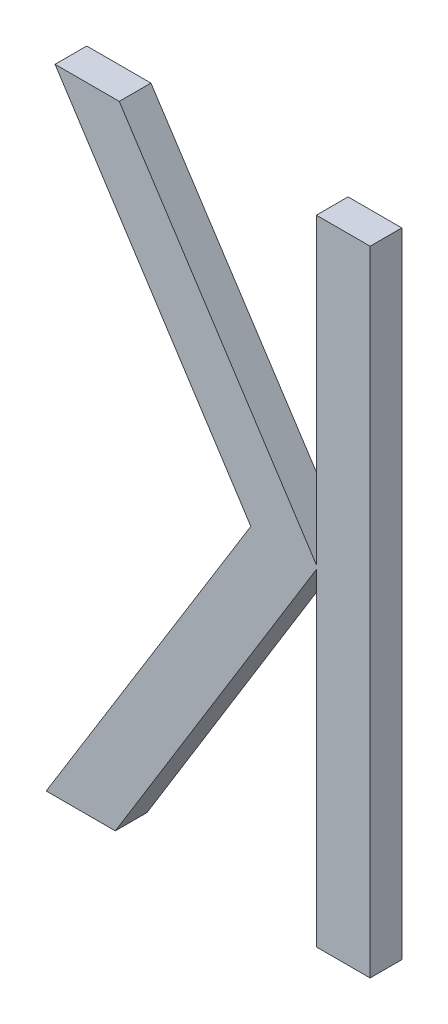
ISO-10303-21;
HEADER;
FILE_DESCRIPTION(('STEP AP214'),'2;1');
FILE_NAME('part.step','',(''),(''),'','','');
FILE_SCHEMA(('AUTOMOTIVE_DESIGN { 1 0 10303 214 1 1 1 1 }'));
ENDSEC;
DATA;
#1=APPLICATION_CONTEXT('core data for automotive mechanical design processes');
#2=APPLICATION_PROTOCOL_DEFINITION('international standard','automotive_design',2000,#1);
#3=PRODUCT_CONTEXT('',#1,'mechanical');
#4=PRODUCT('Part','Part','',(#3));
#5=PRODUCT_RELATED_PRODUCT_CATEGORY('part','',(#4));
#6=PRODUCT_DEFINITION_FORMATION('','',#4);
#7=PRODUCT_DEFINITION_CONTEXT('part definition',#1,'design');
#8=PRODUCT_DEFINITION('design','',#6,#7);
#9=PRODUCT_DEFINITION_SHAPE('','',#8);
#10=(LENGTH_UNIT() NAMED_UNIT(*) SI_UNIT(.MILLI.,.METRE.));
#11=(NAMED_UNIT(*) PLANE_ANGLE_UNIT() SI_UNIT($,.RADIAN.));
#12=(NAMED_UNIT(*) SI_UNIT($,.STERADIAN.) SOLID_ANGLE_UNIT());
#13=UNCERTAINTY_MEASURE_WITH_UNIT(LENGTH_MEASURE(1.E-05),#10,'distance_accuracy_value','');
#14=(GEOMETRIC_REPRESENTATION_CONTEXT(3) GLOBAL_UNCERTAINTY_ASSIGNED_CONTEXT((#13)) GLOBAL_UNIT_ASSIGNED_CONTEXT((#10,
#11,#12)) REPRESENTATION_CONTEXT('',''));
#15=CARTESIAN_POINT('',(0.,0.,0.));
#16=DIRECTION('',(0.,0.,1.));
#17=DIRECTION('',(1.,0.,0.));
#18=AXIS2_PLACEMENT_3D('',#15,#16,#17);
#19=CARTESIAN_POINT('',(184.61228862692,129.252300359681,-38.9997200126349));
#20=DIRECTION('',(0.,0.,-1.));
#21=DIRECTION('',(-1.,0.,0.));
#22=AXIS2_PLACEMENT_3D('',#19,#20,#21);
#23=PLANE('',#22);
#24=DIRECTION('',(0.,1.,0.));
#25=VECTOR('',#24,1.);
#26=CARTESIAN_POINT('',(184.697083866219,129.252300359681,-38.9997200126349));
#27=LINE('',#26,#25);
#28=CARTESIAN_POINT('',(184.697083866219,131.252300359681,-38.9997200126349));
#29=VERTEX_POINT('',#28);
#30=CARTESIAN_POINT('',(184.697083866219,129.252300359681,-38.9997200126349));
#31=VERTEX_POINT('',#30);
#32=EDGE_CURVE('E163',#29,#31,#27,.F.);
#33=ORIENTED_EDGE('',*,*,#32,.F.);
#34=DIRECTION('',(1.,0.,0.));
#35=VECTOR('',#34,1.);
#36=CARTESIAN_POINT('',(184.697083866219,131.252300359681,-38.9997200126349));
#37=LINE('',#36,#35);
#38=CARTESIAN_POINT('',(184.527493387621,131.252300359681,-38.9997200126349));
#39=VERTEX_POINT('',#38);
#40=EDGE_CURVE('E158',#39,#29,#37,.T.);
#41=ORIENTED_EDGE('',*,*,#40,.F.);
#42=DIRECTION('',(0.,1.,0.));
#43=VECTOR('',#42,1.);
#44=CARTESIAN_POINT('',(184.527493387621,131.252300359681,-38.9997200126349));
#45=LINE('',#44,#43);
#46=CARTESIAN_POINT('',(184.527493387621,130.296768332154,-38.9997200126349));
#47=VERTEX_POINT('',#46);
#48=EDGE_CURVE('E152',#47,#39,#45,.T.);
#49=ORIENTED_EDGE('',*,*,#48,.F.);
#50=DIRECTION('',(-0.545601462088926,0.838044774798117,0.));
#51=VECTOR('',#50,1.);
#52=CARTESIAN_POINT('',(184.527493387621,130.296768332154,-38.9997200126349));
#53=LINE('',#52,#51);
#54=CARTESIAN_POINT('',(183.905402913496,131.252300359681,-38.9997200126349));
#55=VERTEX_POINT('',#54);
#56=EDGE_CURVE('E146',#55,#47,#53,.F.);
#57=ORIENTED_EDGE('',*,*,#56,.F.);
#58=DIRECTION('',(1.,0.,0.));
#59=VECTOR('',#58,1.);
#60=CARTESIAN_POINT('',(183.905402913496,131.252300359681,-38.9997200126349));
#61=LINE('',#60,#59);
#62=CARTESIAN_POINT('',(183.702825728535,131.252300359681,-38.9997200126349));
#63=VERTEX_POINT('',#62);
#64=EDGE_CURVE('E140',#63,#55,#61,.T.);
#65=ORIENTED_EDGE('',*,*,#64,.F.);
#66=DIRECTION('',(0.543600897919909,-0.839343829298023,0.));
#67=VECTOR('',#66,1.);
#68=CARTESIAN_POINT('',(183.702825728535,131.252300359681,-38.9997200126349));
#69=LINE('',#68,#67);
#70=CARTESIAN_POINT('',(184.320647334777,130.298356474028,-38.9997200126349));
#71=VERTEX_POINT('',#70);
#72=EDGE_CURVE('E134',#71,#63,#69,.F.);
#73=ORIENTED_EDGE('',*,*,#72,.F.);
#74=DIRECTION('',(-0.525298439908608,-0.850918062465231,0.));
#75=VECTOR('',#74,1.);
#76=CARTESIAN_POINT('',(184.320647334777,130.298356474028,-38.9997200126349));
#77=LINE('',#76,#75);
#78=CARTESIAN_POINT('',(183.67488404785,129.252300359681,-38.9997200126349));
#79=VERTEX_POINT('',#78);
#80=EDGE_CURVE('E128',#79,#71,#77,.F.);
#81=ORIENTED_EDGE('',*,*,#80,.F.);
#82=DIRECTION('',(1.,0.,0.));
#83=VECTOR('',#82,1.);
#84=CARTESIAN_POINT('',(183.67488404785,129.252300359681,-38.9997200126349));
#85=LINE('',#84,#83);
#86=CARTESIAN_POINT('',(183.892984388747,129.252300359681,-38.9997200126349));
#87=VERTEX_POINT('',#86);
#88=EDGE_CURVE('E122',#87,#79,#85,.F.);
#89=ORIENTED_EDGE('',*,*,#88,.F.);
#90=DIRECTION('',(0.523844714133863,0.85181377980989,0.));
#91=VECTOR('',#90,1.);
#92=CARTESIAN_POINT('',(183.892984388747,129.252300359681,-38.9997200126349));
#93=LINE('',#92,#91);
#94=CARTESIAN_POINT('',(184.527493387621,130.284063197162,-38.9997200126349));
#95=VERTEX_POINT('',#94);
#96=EDGE_CURVE('E98',#95,#87,#93,.F.);
#97=ORIENTED_EDGE('',*,*,#96,.F.);
#98=DIRECTION('',(0.,1.,0.));
#99=VECTOR('',#98,1.);
#100=CARTESIAN_POINT('',(184.527493387621,130.284063197162,-38.9997200126349));
#101=LINE('',#100,#99);
#102=CARTESIAN_POINT('',(184.527493387621,129.252300359681,-38.9997200126349));
#103=VERTEX_POINT('',#102);
#104=EDGE_CURVE('E100',#103,#95,#101,.T.);
#105=ORIENTED_EDGE('',*,*,#104,.F.);
#106=DIRECTION('',(1.,0.,0.));
#107=VECTOR('',#106,1.);
#108=CARTESIAN_POINT('',(184.527493387621,129.252300359681,-38.9997200126349));
#109=LINE('',#108,#107);
#110=EDGE_CURVE('E20',#31,#103,#109,.F.);
#111=ORIENTED_EDGE('',*,*,#110,.F.);
#112=EDGE_LOOP('',(#33,#41,#49,#57,#65,#73,#81,#89,#97,#105,#111));
#113=FACE_BOUND('',#112,.T.);
#114=ADVANCED_FACE('F17',(#113),#23,.F.);
#115=CARTESIAN_POINT('',(184.527493387621,129.252300359681,-39.0997200126349));
#116=DIRECTION('',(0.,-1.,0.));
#117=DIRECTION('',(0.,0.,-1.));
#118=AXIS2_PLACEMENT_3D('',#115,#116,#117);
#119=PLANE('',#118);
#120=DIRECTION('',(-1.,0.,0.));
#121=VECTOR('',#120,1.);
#122=CARTESIAN_POINT('',(184.61228862692,129.252300359681,-39.0997200126349));
#123=LINE('',#122,#121);
#124=CARTESIAN_POINT('',(184.697083866219,129.252300359681,-39.0997200126349));
#125=VERTEX_POINT('',#124);
#126=CARTESIAN_POINT('',(184.527493387621,129.252300359681,-39.0997200126349));
#127=VERTEX_POINT('',#126);
#128=EDGE_CURVE('E167',#125,#127,#123,.T.);
#129=ORIENTED_EDGE('',*,*,#128,.F.);
#130=DIRECTION('',(0.,0.,-1.));
#131=VECTOR('',#130,1.);
#132=CARTESIAN_POINT('',(184.697083866219,129.252300359681,-39.0997200126349));
#133=LINE('',#132,#131);
#134=EDGE_CURVE('E111',#31,#125,#133,.T.);
#135=ORIENTED_EDGE('',*,*,#134,.F.);
#136=ORIENTED_EDGE('',*,*,#110,.T.);
#137=DIRECTION('',(0.,0.,1.));
#138=VECTOR('',#137,1.);
#139=CARTESIAN_POINT('',(184.527493387621,129.252300359681,-39.0997200126349));
#140=LINE('',#139,#138);
#141=EDGE_CURVE('E106',#127,#103,#140,.T.);
#142=ORIENTED_EDGE('',*,*,#141,.F.);
#143=EDGE_LOOP('',(#129,#135,#136,#142));
#144=FACE_BOUND('',#143,.T.);
#145=ADVANCED_FACE('F108',(#144),#119,.T.);
#146=CARTESIAN_POINT('',(184.527493387621,130.284063197162,-39.0997200126349));
#147=DIRECTION('',(-1.,0.,0.));
#148=DIRECTION('',(0.,0.,1.));
#149=AXIS2_PLACEMENT_3D('',#146,#147,#148);
#150=PLANE('',#149);
#151=DIRECTION('',(0.,1.,0.));
#152=VECTOR('',#151,1.);
#153=CARTESIAN_POINT('',(184.527493387621,129.252300359681,-39.0997200126349));
#154=LINE('',#153,#152);
#155=CARTESIAN_POINT('',(184.527493387621,130.284063197162,-39.0997200126349));
#156=VERTEX_POINT('',#155);
#157=EDGE_CURVE('E115',#127,#156,#154,.T.);
#158=ORIENTED_EDGE('',*,*,#157,.F.);
#159=ORIENTED_EDGE('',*,*,#141,.T.);
#160=ORIENTED_EDGE('',*,*,#104,.T.);
#161=DIRECTION('',(0.,0.,1.));
#162=VECTOR('',#161,1.);
#163=CARTESIAN_POINT('',(184.527493387621,130.284063197162,-39.0997200126349));
#164=LINE('',#163,#162);
#165=EDGE_CURVE('E118',#156,#95,#164,.T.);
#166=ORIENTED_EDGE('',*,*,#165,.F.);
#167=EDGE_LOOP('',(#158,#159,#160,#166));
#168=FACE_BOUND('',#167,.T.);
#169=ADVANCED_FACE('F113',(#168),#150,.T.);
#170=CARTESIAN_POINT('',(183.892984388747,129.252300359681,-39.0997200126349));
#171=DIRECTION('',(0.85181377980989,-0.523844714133863,0.));
#172=DIRECTION('',(0.523844714133863,0.85181377980989,0.));
#173=AXIS2_PLACEMENT_3D('',#170,#171,#172);
#174=PLANE('',#173);
#175=DIRECTION('',(-0.523844714133879,-0.85181377980988,0.));
#176=VECTOR('',#175,1.);
#177=CARTESIAN_POINT('',(184.527493387621,130.284063197162,-39.0997200126349));
#178=LINE('',#177,#176);
#179=CARTESIAN_POINT('',(183.892984388747,129.252300359681,-39.0997200126349));
#180=VERTEX_POINT('',#179);
#181=EDGE_CURVE('E170',#156,#180,#178,.T.);
#182=ORIENTED_EDGE('',*,*,#181,.F.);
#183=ORIENTED_EDGE('',*,*,#165,.T.);
#184=ORIENTED_EDGE('',*,*,#96,.T.);
#185=DIRECTION('',(0.,0.,-1.));
#186=VECTOR('',#185,1.);
#187=CARTESIAN_POINT('',(183.892984388747,129.252300359681,-39.0997200126349));
#188=LINE('',#187,#186);
#189=EDGE_CURVE('E125',#180,#87,#188,.F.);
#190=ORIENTED_EDGE('',*,*,#189,.F.);
#191=EDGE_LOOP('',(#182,#183,#184,#190));
#192=FACE_BOUND('',#191,.T.);
#193=ADVANCED_FACE('F215',(#192),#174,.T.);
#194=CARTESIAN_POINT('',(183.67488404785,129.252300359681,-39.0997200126349));
#195=DIRECTION('',(0.,-1.,0.));
#196=DIRECTION('',(0.,0.,-1.));
#197=AXIS2_PLACEMENT_3D('',#194,#195,#196);
#198=PLANE('',#197);
#199=DIRECTION('',(-1.,0.,0.));
#200=VECTOR('',#199,1.);
#201=CARTESIAN_POINT('',(184.61228862692,129.252300359681,-39.0997200126349));
#202=LINE('',#201,#200);
#203=CARTESIAN_POINT('',(183.67488404785,129.252300359681,-39.0997200126349));
#204=VERTEX_POINT('',#203);
#205=EDGE_CURVE('E173',#180,#204,#202,.T.);
#206=ORIENTED_EDGE('',*,*,#205,.F.);
#207=ORIENTED_EDGE('',*,*,#189,.T.);
#208=ORIENTED_EDGE('',*,*,#88,.T.);
#209=DIRECTION('',(0.,0.,1.));
#210=VECTOR('',#209,1.);
#211=CARTESIAN_POINT('',(183.67488404785,129.252300359681,-39.0997200126349));
#212=LINE('',#211,#210);
#213=EDGE_CURVE('E131',#204,#79,#212,.T.);
#214=ORIENTED_EDGE('',*,*,#213,.F.);
#215=EDGE_LOOP('',(#206,#207,#208,#214));
#216=FACE_BOUND('',#215,.T.);
#217=ADVANCED_FACE('F212',(#216),#198,.T.);
#218=CARTESIAN_POINT('',(184.320647334777,130.298356474028,-39.0997200126349));
#219=DIRECTION('',(-0.850918062465231,0.525298439908608,0.));
#220=DIRECTION('',(-0.525298439908608,-0.850918062465231,0.));
#221=AXIS2_PLACEMENT_3D('',#218,#219,#220);
#222=PLANE('',#221);
#223=DIRECTION('',(0.525298439908616,0.850918062465226,0.));
#224=VECTOR('',#223,1.);
#225=CARTESIAN_POINT('',(183.67488404785,129.252300359681,-39.0997200126349));
#226=LINE('',#225,#224);
#227=CARTESIAN_POINT('',(184.320647334777,130.298356474028,-39.0997200126349));
#228=VERTEX_POINT('',#227);
#229=EDGE_CURVE('E176',#204,#228,#226,.T.);
#230=ORIENTED_EDGE('',*,*,#229,.F.);
#231=ORIENTED_EDGE('',*,*,#213,.T.);
#232=ORIENTED_EDGE('',*,*,#80,.T.);
#233=DIRECTION('',(0.,0.,1.));
#234=VECTOR('',#233,1.);
#235=CARTESIAN_POINT('',(184.320647334777,130.298356474028,-39.0997200126349));
#236=LINE('',#235,#234);
#237=EDGE_CURVE('E137',#228,#71,#236,.T.);
#238=ORIENTED_EDGE('',*,*,#237,.F.);
#239=EDGE_LOOP('',(#230,#231,#232,#238));
#240=FACE_BOUND('',#239,.T.);
#241=ADVANCED_FACE('F209',(#240),#222,.T.);
#242=CARTESIAN_POINT('',(183.702825728535,131.252300359681,-39.0997200126349));
#243=DIRECTION('',(-0.839343829298023,-0.543600897919909,0.));
#244=DIRECTION('',(0.543600897919909,-0.839343829298023,0.));
#245=AXIS2_PLACEMENT_3D('',#242,#243,#244);
#246=PLANE('',#245);
#247=DIRECTION('',(-0.543600897919943,0.839343829298001,0.));
#248=VECTOR('',#247,1.);
#249=CARTESIAN_POINT('',(184.320647334777,130.298356474028,-39.0997200126349));
#250=LINE('',#249,#248);
#251=CARTESIAN_POINT('',(183.702825728535,131.252300359681,-39.0997200126349));
#252=VERTEX_POINT('',#251);
#253=EDGE_CURVE('E179',#228,#252,#250,.T.);
#254=ORIENTED_EDGE('',*,*,#253,.F.);
#255=ORIENTED_EDGE('',*,*,#237,.T.);
#256=ORIENTED_EDGE('',*,*,#72,.T.);
#257=DIRECTION('',(0.,0.,1.));
#258=VECTOR('',#257,1.);
#259=CARTESIAN_POINT('',(183.702825728535,131.252300359681,-39.0997200126349));
#260=LINE('',#259,#258);
#261=EDGE_CURVE('E143',#252,#63,#260,.T.);
#262=ORIENTED_EDGE('',*,*,#261,.F.);
#263=EDGE_LOOP('',(#254,#255,#256,#262));
#264=FACE_BOUND('',#263,.T.);
#265=ADVANCED_FACE('F206',(#264),#246,.T.);
#266=CARTESIAN_POINT('',(183.905402913496,131.252300359681,-39.0997200126349));
#267=DIRECTION('',(0.,1.,0.));
#268=DIRECTION('',(0.,0.,1.));
#269=AXIS2_PLACEMENT_3D('',#266,#267,#268);
#270=PLANE('',#269);
#271=DIRECTION('',(-1.,0.,0.));
#272=VECTOR('',#271,1.);
#273=CARTESIAN_POINT('',(184.61228862692,131.252300359681,-39.0997200126349));
#274=LINE('',#273,#272);
#275=CARTESIAN_POINT('',(183.905402913496,131.252300359681,-39.0997200126349));
#276=VERTEX_POINT('',#275);
#277=EDGE_CURVE('E182',#252,#276,#274,.F.);
#278=ORIENTED_EDGE('',*,*,#277,.F.);
#279=ORIENTED_EDGE('',*,*,#261,.T.);
#280=ORIENTED_EDGE('',*,*,#64,.T.);
#281=DIRECTION('',(0.,0.,1.));
#282=VECTOR('',#281,1.);
#283=CARTESIAN_POINT('',(183.905402913496,131.252300359681,-39.0997200126349));
#284=LINE('',#283,#282);
#285=EDGE_CURVE('E149',#276,#55,#284,.T.);
#286=ORIENTED_EDGE('',*,*,#285,.F.);
#287=EDGE_LOOP('',(#278,#279,#280,#286));
#288=FACE_BOUND('',#287,.T.);
#289=ADVANCED_FACE('F203',(#288),#270,.T.);
#290=CARTESIAN_POINT('',(184.527493387621,130.296768332154,-39.0997200126349));
#291=DIRECTION('',(0.838044774798117,0.545601462088926,0.));
#292=DIRECTION('',(-0.545601462088926,0.838044774798117,0.));
#293=AXIS2_PLACEMENT_3D('',#290,#291,#292);
#294=PLANE('',#293);
#295=DIRECTION('',(0.545601462088909,-0.838044774798128,0.));
#296=VECTOR('',#295,1.);
#297=CARTESIAN_POINT('',(183.905402913496,131.252300359681,-39.0997200126349));
#298=LINE('',#297,#296);
#299=CARTESIAN_POINT('',(184.527493387621,130.296768332154,-39.0997200126349));
#300=VERTEX_POINT('',#299);
#301=EDGE_CURVE('E185',#276,#300,#298,.T.);
#302=ORIENTED_EDGE('',*,*,#301,.F.);
#303=ORIENTED_EDGE('',*,*,#285,.T.);
#304=ORIENTED_EDGE('',*,*,#56,.T.);
#305=DIRECTION('',(0.,0.,1.));
#306=VECTOR('',#305,1.);
#307=CARTESIAN_POINT('',(184.527493387621,130.296768332154,-39.0997200126349));
#308=LINE('',#307,#306);
#309=EDGE_CURVE('E155',#300,#47,#308,.T.);
#310=ORIENTED_EDGE('',*,*,#309,.F.);
#311=EDGE_LOOP('',(#302,#303,#304,#310));
#312=FACE_BOUND('',#311,.T.);
#313=ADVANCED_FACE('F200',(#312),#294,.T.);
#314=CARTESIAN_POINT('',(184.527493387621,131.252300359681,-39.0997200126349));
#315=DIRECTION('',(-1.,0.,0.));
#316=DIRECTION('',(0.,0.,1.));
#317=AXIS2_PLACEMENT_3D('',#314,#315,#316);
#318=PLANE('',#317);
#319=DIRECTION('',(0.,1.,0.));
#320=VECTOR('',#319,1.);
#321=CARTESIAN_POINT('',(184.527493387621,129.252300359681,-39.0997200126349));
#322=LINE('',#321,#320);
#323=CARTESIAN_POINT('',(184.527493387621,131.252300359681,-39.0997200126349));
#324=VERTEX_POINT('',#323);
#325=EDGE_CURVE('E188',#300,#324,#322,.T.);
#326=ORIENTED_EDGE('',*,*,#325,.F.);
#327=ORIENTED_EDGE('',*,*,#309,.T.);
#328=ORIENTED_EDGE('',*,*,#48,.T.);
#329=DIRECTION('',(0.,0.,1.));
#330=VECTOR('',#329,1.);
#331=CARTESIAN_POINT('',(184.527493387621,131.252300359681,-39.0997200126349));
#332=LINE('',#331,#330);
#333=EDGE_CURVE('E160',#324,#39,#332,.T.);
#334=ORIENTED_EDGE('',*,*,#333,.F.);
#335=EDGE_LOOP('',(#326,#327,#328,#334));
#336=FACE_BOUND('',#335,.T.);
#337=ADVANCED_FACE('F197',(#336),#318,.T.);
#338=CARTESIAN_POINT('',(184.697083866219,131.252300359681,-39.0997200126349));
#339=DIRECTION('',(0.,1.,0.));
#340=DIRECTION('',(0.,0.,1.));
#341=AXIS2_PLACEMENT_3D('',#338,#339,#340);
#342=PLANE('',#341);
#343=DIRECTION('',(-1.,0.,0.));
#344=VECTOR('',#343,1.);
#345=CARTESIAN_POINT('',(184.61228862692,131.252300359681,-39.0997200126349));
#346=LINE('',#345,#344);
#347=CARTESIAN_POINT('',(184.697083866219,131.252300359681,-39.0997200126349));
#348=VERTEX_POINT('',#347);
#349=EDGE_CURVE('E26',#324,#348,#346,.F.);
#350=ORIENTED_EDGE('',*,*,#349,.F.);
#351=ORIENTED_EDGE('',*,*,#333,.T.);
#352=ORIENTED_EDGE('',*,*,#40,.T.);
#353=DIRECTION('',(0.,0.,-1.));
#354=VECTOR('',#353,1.);
#355=CARTESIAN_POINT('',(184.697083866219,131.252300359681,-39.0997200126349));
#356=LINE('',#355,#354);
#357=EDGE_CURVE('E35',#348,#29,#356,.F.);
#358=ORIENTED_EDGE('',*,*,#357,.F.);
#359=EDGE_LOOP('',(#350,#351,#352,#358));
#360=FACE_BOUND('',#359,.T.);
#361=ADVANCED_FACE('F195',(#360),#342,.T.);
#362=CARTESIAN_POINT('',(184.697083866219,129.252300359681,-39.0997200126349));
#363=DIRECTION('',(1.,0.,0.));
#364=DIRECTION('',(0.,0.,-1.));
#365=AXIS2_PLACEMENT_3D('',#362,#363,#364);
#366=PLANE('',#365);
#367=DIRECTION('',(0.,1.,0.));
#368=VECTOR('',#367,1.);
#369=CARTESIAN_POINT('',(184.697083866219,129.252300359681,-39.0997200126349));
#370=LINE('',#369,#368);
#371=EDGE_CURVE('E11',#348,#125,#370,.F.);
#372=ORIENTED_EDGE('',*,*,#371,.F.);
#373=ORIENTED_EDGE('',*,*,#357,.T.);
#374=ORIENTED_EDGE('',*,*,#32,.T.);
#375=ORIENTED_EDGE('',*,*,#134,.T.);
#376=EDGE_LOOP('',(#372,#373,#374,#375));
#377=FACE_BOUND('',#376,.T.);
#378=ADVANCED_FACE('F217',(#377),#366,.T.);
#379=CARTESIAN_POINT('',(184.61228862692,129.252300359681,-39.0997200126349));
#380=DIRECTION('',(0.,0.,-1.));
#381=DIRECTION('',(-1.,0.,0.));
#382=AXIS2_PLACEMENT_3D('',#379,#380,#381);
#383=PLANE('',#382);
#384=ORIENTED_EDGE('',*,*,#349,.T.);
#385=ORIENTED_EDGE('',*,*,#371,.T.);
#386=ORIENTED_EDGE('',*,*,#128,.T.);
#387=ORIENTED_EDGE('',*,*,#157,.T.);
#388=ORIENTED_EDGE('',*,*,#181,.T.);
#389=ORIENTED_EDGE('',*,*,#205,.T.);
#390=ORIENTED_EDGE('',*,*,#229,.T.);
#391=ORIENTED_EDGE('',*,*,#253,.T.);
#392=ORIENTED_EDGE('',*,*,#277,.T.);
#393=ORIENTED_EDGE('',*,*,#301,.T.);
#394=ORIENTED_EDGE('',*,*,#325,.T.);
#395=EDGE_LOOP('',(#384,#385,#386,#387,#388,#389,#390,#391,#392,#393,#394));
#396=FACE_BOUND('',#395,.T.);
#397=ADVANCED_FACE('F193',(#396),#383,.T.);
#398=CLOSED_SHELL('',(#114,#145,#169,#193,#217,#241,#265,#289,#313,#337,#361,#378,#397));
#399=MANIFOLD_SOLID_BREP('B1',#398);
#400=ADVANCED_BREP_SHAPE_REPRESENTATION('',(#18,#399),#14);
#401=SHAPE_DEFINITION_REPRESENTATION(#9,#400);
ENDSEC;
END-ISO-10303-21;
